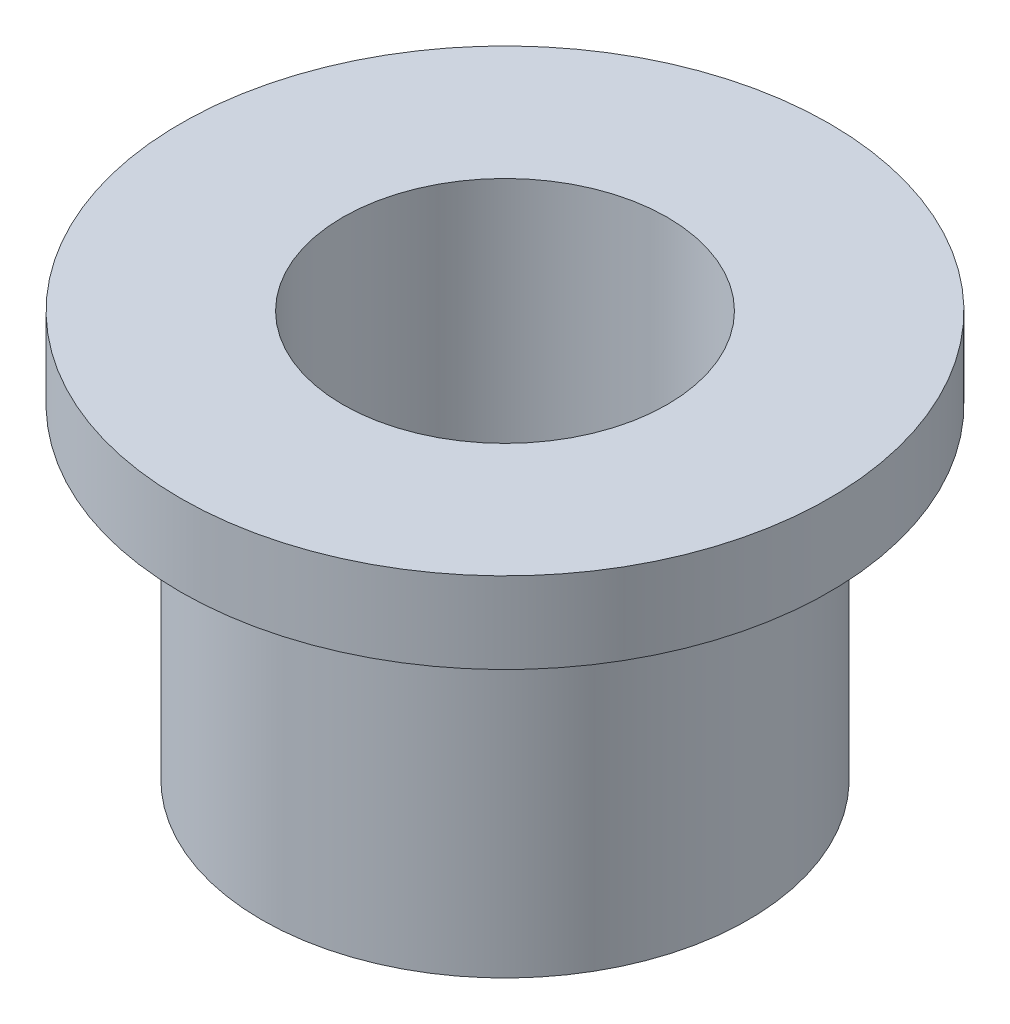
ISO-10303-21;
HEADER;
FILE_DESCRIPTION(('STEP AP214'),'2;1');
FILE_NAME('part.step','',(''),(''),'','','');
FILE_SCHEMA(('AUTOMOTIVE_DESIGN { 1 0 10303 214 1 1 1 1 }'));
ENDSEC;
DATA;
#1=APPLICATION_CONTEXT('core data for automotive mechanical design processes');
#2=APPLICATION_PROTOCOL_DEFINITION('international standard','automotive_design',2000,#1);
#3=PRODUCT_CONTEXT('',#1,'mechanical');
#4=PRODUCT('Part','Part','',(#3));
#5=PRODUCT_RELATED_PRODUCT_CATEGORY('part','',(#4));
#6=PRODUCT_DEFINITION_FORMATION('','',#4);
#7=PRODUCT_DEFINITION_CONTEXT('part definition',#1,'design');
#8=PRODUCT_DEFINITION('design','',#6,#7);
#9=PRODUCT_DEFINITION_SHAPE('','',#8);
#10=(LENGTH_UNIT() NAMED_UNIT(*) SI_UNIT(.MILLI.,.METRE.));
#11=(NAMED_UNIT(*) PLANE_ANGLE_UNIT() SI_UNIT($,.RADIAN.));
#12=(NAMED_UNIT(*) SI_UNIT($,.STERADIAN.) SOLID_ANGLE_UNIT());
#13=UNCERTAINTY_MEASURE_WITH_UNIT(LENGTH_MEASURE(1.E-05),#10,'distance_accuracy_value','');
#14=(GEOMETRIC_REPRESENTATION_CONTEXT(3) GLOBAL_UNCERTAINTY_ASSIGNED_CONTEXT((#13)) GLOBAL_UNIT_ASSIGNED_CONTEXT((#10,
#11,#12)) REPRESENTATION_CONTEXT('',''));
#15=CARTESIAN_POINT('',(0.,0.,0.));
#16=DIRECTION('',(0.,0.,1.));
#17=DIRECTION('',(1.,0.,0.));
#18=AXIS2_PLACEMENT_3D('',#15,#16,#17);
#19=CARTESIAN_POINT('',(0.,0.,-4.7625));
#20=DIRECTION('',(0.,-1.,0.));
#21=DIRECTION('',(0.,0.,-1.));
#22=AXIS2_PLACEMENT_3D('',#19,#20,#21);
#23=PLANE('',#22);
#24=CARTESIAN_POINT('',(0.,0.,0.));
#25=DIRECTION('',(0.,-1.,0.));
#26=DIRECTION('',(0.,0.,-1.));
#27=AXIS2_PLACEMENT_3D('',#24,#25,#26);
#28=CIRCLE('',#27,4.7625);
#29=CARTESIAN_POINT('',(0.,0.,-4.7625));
#30=VERTEX_POINT('',#29);
#31=EDGE_CURVE('E58',#30,#30,#28,.T.);
#32=ORIENTED_EDGE('',*,*,#31,.T.);
#33=EDGE_LOOP('',(#32));
#34=FACE_BOUND('',#33,.T.);
#35=CARTESIAN_POINT('',(0.,0.,0.));
#36=DIRECTION('',(0.,-1.,0.));
#37=DIRECTION('',(0.,0.,-1.));
#38=AXIS2_PLACEMENT_3D('',#35,#36,#37);
#39=CIRCLE('',#38,3.175);
#40=CARTESIAN_POINT('',(0.,0.,-3.175));
#41=VERTEX_POINT('',#40);
#42=EDGE_CURVE('E10',#41,#41,#39,.T.);
#43=ORIENTED_EDGE('',*,*,#42,.F.);
#44=EDGE_LOOP('',(#43));
#45=FACE_BOUND('',#44,.T.);
#46=ADVANCED_FACE('F35',(#34,#45),#23,.T.);
#47=CARTESIAN_POINT('',(0.,0.,0.));
#48=DIRECTION('',(0.,-1.,0.));
#49=DIRECTION('',(0.,0.,-1.));
#50=AXIS2_PLACEMENT_3D('',#47,#48,#49);
#51=CYLINDRICAL_SURFACE('',#50,3.175);
#52=ORIENTED_EDGE('',*,*,#42,.T.);
#53=EDGE_LOOP('',(#52));
#54=FACE_BOUND('',#53,.T.);
#55=CARTESIAN_POINT('',(0.,7.9375,0.));
#56=DIRECTION('',(0.,-1.,0.));
#57=DIRECTION('',(0.,0.,-1.));
#58=AXIS2_PLACEMENT_3D('',#55,#56,#57);
#59=CIRCLE('',#58,3.175);
#60=CARTESIAN_POINT('',(0.,7.9375,-3.175));
#61=VERTEX_POINT('',#60);
#62=EDGE_CURVE('E41',#61,#61,#59,.T.);
#63=ORIENTED_EDGE('',*,*,#62,.F.);
#64=EDGE_LOOP('',(#63));
#65=FACE_BOUND('',#64,.T.);
#66=ADVANCED_FACE('F76',(#54,#65),#51,.F.);
#67=CARTESIAN_POINT('',(0.,7.9375,-3.175));
#68=DIRECTION('',(0.,1.,0.));
#69=DIRECTION('',(0.,0.,1.));
#70=AXIS2_PLACEMENT_3D('',#67,#68,#69);
#71=PLANE('',#70);
#72=ORIENTED_EDGE('',*,*,#62,.T.);
#73=EDGE_LOOP('',(#72));
#74=FACE_BOUND('',#73,.T.);
#75=CARTESIAN_POINT('',(0.,7.93750000000001,0.));
#76=DIRECTION('',(0.,-1.,0.));
#77=DIRECTION('',(0.,0.,-1.));
#78=AXIS2_PLACEMENT_3D('',#75,#76,#77);
#79=CIRCLE('',#78,6.35);
#80=CARTESIAN_POINT('',(0.,7.93750000000001,-6.35));
#81=VERTEX_POINT('',#80);
#82=EDGE_CURVE('E46',#81,#81,#79,.T.);
#83=ORIENTED_EDGE('',*,*,#82,.F.);
#84=EDGE_LOOP('',(#83));
#85=FACE_BOUND('',#84,.T.);
#86=ADVANCED_FACE('F80',(#74,#85),#71,.T.);
#87=CARTESIAN_POINT('',(0.,0.,0.));
#88=DIRECTION('',(0.,-1.,0.));
#89=DIRECTION('',(0.,0.,-1.));
#90=AXIS2_PLACEMENT_3D('',#87,#88,#89);
#91=CYLINDRICAL_SURFACE('',#90,6.35);
#92=ORIENTED_EDGE('',*,*,#82,.T.);
#93=EDGE_LOOP('',(#92));
#94=FACE_BOUND('',#93,.T.);
#95=CARTESIAN_POINT('',(0.,6.35,0.));
#96=DIRECTION('',(0.,-1.,0.));
#97=DIRECTION('',(0.,0.,-1.));
#98=AXIS2_PLACEMENT_3D('',#95,#96,#97);
#99=CIRCLE('',#98,6.35);
#100=CARTESIAN_POINT('',(0.,6.35,-6.35));
#101=VERTEX_POINT('',#100);
#102=EDGE_CURVE('E50',#101,#101,#99,.T.);
#103=ORIENTED_EDGE('',*,*,#102,.F.);
#104=EDGE_LOOP('',(#103));
#105=FACE_BOUND('',#104,.T.);
#106=ADVANCED_FACE('F72',(#94,#105),#91,.T.);
#107=CARTESIAN_POINT('',(0.,6.35,-6.35));
#108=DIRECTION('',(0.,-1.,0.));
#109=DIRECTION('',(0.,0.,-1.));
#110=AXIS2_PLACEMENT_3D('',#107,#108,#109);
#111=PLANE('',#110);
#112=ORIENTED_EDGE('',*,*,#102,.T.);
#113=EDGE_LOOP('',(#112));
#114=FACE_BOUND('',#113,.T.);
#115=CARTESIAN_POINT('',(0.,6.35,0.));
#116=DIRECTION('',(0.,-1.,0.));
#117=DIRECTION('',(0.,0.,-1.));
#118=AXIS2_PLACEMENT_3D('',#115,#116,#117);
#119=CIRCLE('',#118,4.7625);
#120=CARTESIAN_POINT('',(0.,6.35,-4.7625));
#121=VERTEX_POINT('',#120);
#122=EDGE_CURVE('E55',#121,#121,#119,.T.);
#123=ORIENTED_EDGE('',*,*,#122,.F.);
#124=EDGE_LOOP('',(#123));
#125=FACE_BOUND('',#124,.T.);
#126=ADVANCED_FACE('F66',(#114,#125),#111,.T.);
#127=CARTESIAN_POINT('',(0.,0.,0.));
#128=DIRECTION('',(0.,-1.,0.));
#129=DIRECTION('',(0.,0.,-1.));
#130=AXIS2_PLACEMENT_3D('',#127,#128,#129);
#131=CYLINDRICAL_SURFACE('',#130,4.7625);
#132=ORIENTED_EDGE('',*,*,#122,.T.);
#133=EDGE_LOOP('',(#132));
#134=FACE_BOUND('',#133,.T.);
#135=ORIENTED_EDGE('',*,*,#31,.F.);
#136=EDGE_LOOP('',(#135));
#137=FACE_BOUND('',#136,.T.);
#138=ADVANCED_FACE('F64',(#134,#137),#131,.T.);
#139=CLOSED_SHELL('',(#46,#66,#86,#106,#126,#138));
#140=MANIFOLD_SOLID_BREP('B2',#139);
#141=ADVANCED_BREP_SHAPE_REPRESENTATION('',(#18,#140),#14);
#142=SHAPE_DEFINITION_REPRESENTATION(#9,#141);
ENDSEC;
END-ISO-10303-21;
